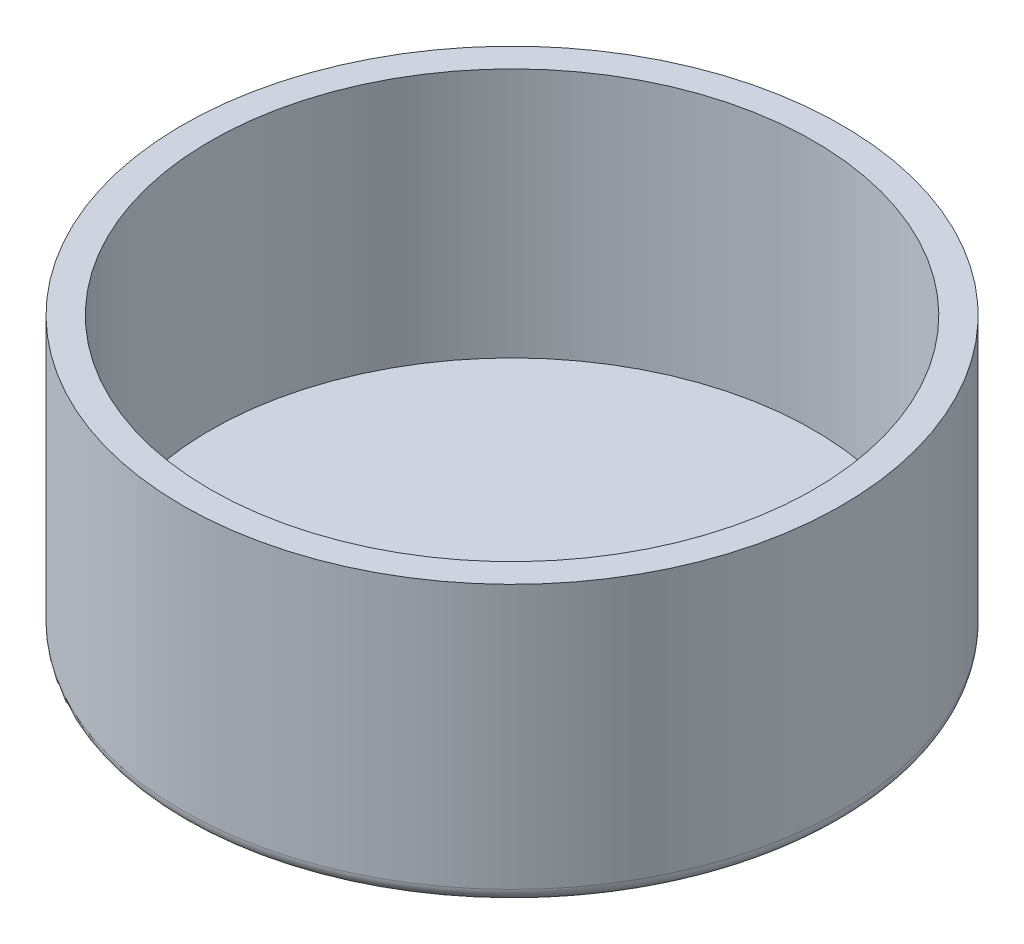
ISO-10303-21;
HEADER;
FILE_DESCRIPTION(('STEP AP214'),'2;1');
FILE_NAME('part.step','',(''),(''),'','','');
FILE_SCHEMA(('AUTOMOTIVE_DESIGN { 1 0 10303 214 1 1 1 1 }'));
ENDSEC;
DATA;
#1=APPLICATION_CONTEXT('core data for automotive mechanical design processes');
#2=APPLICATION_PROTOCOL_DEFINITION('international standard','automotive_design',2000,#1);
#3=PRODUCT_CONTEXT('',#1,'mechanical');
#4=PRODUCT('Part','Part','',(#3));
#5=PRODUCT_RELATED_PRODUCT_CATEGORY('part','',(#4));
#6=PRODUCT_DEFINITION_FORMATION('','',#4);
#7=PRODUCT_DEFINITION_CONTEXT('part definition',#1,'design');
#8=PRODUCT_DEFINITION('design','',#6,#7);
#9=PRODUCT_DEFINITION_SHAPE('','',#8);
#10=(LENGTH_UNIT() NAMED_UNIT(*) SI_UNIT(.MILLI.,.METRE.));
#11=(NAMED_UNIT(*) PLANE_ANGLE_UNIT() SI_UNIT($,.RADIAN.));
#12=(NAMED_UNIT(*) SI_UNIT($,.STERADIAN.) SOLID_ANGLE_UNIT());
#13=UNCERTAINTY_MEASURE_WITH_UNIT(LENGTH_MEASURE(1.E-05),#10,'distance_accuracy_value','');
#14=(GEOMETRIC_REPRESENTATION_CONTEXT(3) GLOBAL_UNCERTAINTY_ASSIGNED_CONTEXT((#13)) GLOBAL_UNIT_ASSIGNED_CONTEXT((#10,
#11,#12)) REPRESENTATION_CONTEXT('',''));
#15=CARTESIAN_POINT('',(0.,0.,0.));
#16=DIRECTION('',(0.,0.,1.));
#17=DIRECTION('',(1.,0.,0.));
#18=AXIS2_PLACEMENT_3D('',#15,#16,#17);
#19=CARTESIAN_POINT('',(0.,1.,0.));
#20=DIRECTION('',(0.,-1.,0.));
#21=DIRECTION('',(0.,0.,-1.));
#22=AXIS2_PLACEMENT_3D('',#19,#20,#21);
#23=CYLINDRICAL_SURFACE('',#22,11.85);
#24=CARTESIAN_POINT('',(0.,0.5,0.));
#25=DIRECTION('',(0.,1.,0.));
#26=DIRECTION('',(0.,0.,1.));
#27=AXIS2_PLACEMENT_3D('',#24,#25,#26);
#28=CIRCLE('',#27,11.85);
#29=CARTESIAN_POINT('',(0.,0.5,11.85));
#30=VERTEX_POINT('',#29);
#31=EDGE_CURVE('E42',#30,#30,#28,.T.);
#32=ORIENTED_EDGE('',*,*,#31,.T.);
#33=EDGE_LOOP('',(#32));
#34=FACE_BOUND('',#33,.T.);
#35=CARTESIAN_POINT('',(0.,10.,0.));
#36=DIRECTION('',(0.,1.,0.));
#37=DIRECTION('',(0.,0.,1.));
#38=AXIS2_PLACEMENT_3D('',#35,#36,#37);
#39=CIRCLE('',#38,11.85);
#40=CARTESIAN_POINT('',(0.,10.,11.85));
#41=VERTEX_POINT('',#40);
#42=EDGE_CURVE('E50',#41,#41,#39,.T.);
#43=ORIENTED_EDGE('',*,*,#42,.F.);
#44=EDGE_LOOP('',(#43));
#45=FACE_BOUND('',#44,.T.);
#46=ADVANCED_FACE('F35',(#34,#45),#23,.T.);
#47=CARTESIAN_POINT('',(0.,0.,0.));
#48=DIRECTION('',(0.,1.,0.));
#49=DIRECTION('',(0.,0.,1.));
#50=AXIS2_PLACEMENT_3D('',#47,#48,#49);
#51=PLANE('',#50);
#52=CARTESIAN_POINT('',(0.,0.,0.));
#53=DIRECTION('',(0.,1.,0.));
#54=DIRECTION('',(0.,0.,1.));
#55=AXIS2_PLACEMENT_3D('',#52,#53,#54);
#56=CIRCLE('',#55,11.35);
#57=CARTESIAN_POINT('',(0.,0.,11.35));
#58=VERTEX_POINT('',#57);
#59=EDGE_CURVE('E10',#58,#58,#56,.F.);
#60=ORIENTED_EDGE('',*,*,#59,.T.);
#61=EDGE_LOOP('',(#60));
#62=FACE_BOUND('',#61,.T.);
#63=ADVANCED_FACE('F64',(#62),#51,.F.);
#64=CARTESIAN_POINT('',(0.,10.,0.));
#65=DIRECTION('',(0.,1.,0.));
#66=DIRECTION('',(0.,0.,1.));
#67=AXIS2_PLACEMENT_3D('',#64,#65,#66);
#68=PLANE('',#67);
#69=ORIENTED_EDGE('',*,*,#42,.T.);
#70=EDGE_LOOP('',(#69));
#71=FACE_BOUND('',#70,.T.);
#72=CARTESIAN_POINT('',(0.,10.,0.));
#73=DIRECTION('',(0.,1.,0.));
#74=DIRECTION('',(0.,0.,1.));
#75=AXIS2_PLACEMENT_3D('',#72,#73,#74);
#76=CIRCLE('',#75,10.85);
#77=CARTESIAN_POINT('',(0.,10.,10.85));
#78=VERTEX_POINT('',#77);
#79=EDGE_CURVE('E55',#78,#78,#76,.T.);
#80=ORIENTED_EDGE('',*,*,#79,.F.);
#81=EDGE_LOOP('',(#80));
#82=FACE_BOUND('',#81,.T.);
#83=ADVANCED_FACE('F62',(#71,#82),#68,.T.);
#84=CARTESIAN_POINT('',(0.,10.,0.));
#85=DIRECTION('',(0.,-1.,0.));
#86=DIRECTION('',(0.,0.,-1.));
#87=AXIS2_PLACEMENT_3D('',#84,#85,#86);
#88=CYLINDRICAL_SURFACE('',#87,10.85);
#89=ORIENTED_EDGE('',*,*,#79,.T.);
#90=EDGE_LOOP('',(#89));
#91=FACE_BOUND('',#90,.T.);
#92=CARTESIAN_POINT('',(0.,1.,0.));
#93=DIRECTION('',(0.,1.,0.));
#94=DIRECTION('',(0.,0.,1.));
#95=AXIS2_PLACEMENT_3D('',#92,#93,#94);
#96=CIRCLE('',#95,10.85);
#97=CARTESIAN_POINT('',(0.,1.,10.85));
#98=VERTEX_POINT('',#97);
#99=EDGE_CURVE('E46',#98,#98,#96,.F.);
#100=ORIENTED_EDGE('',*,*,#99,.T.);
#101=EDGE_LOOP('',(#100));
#102=FACE_BOUND('',#101,.T.);
#103=ADVANCED_FACE('F59',(#91,#102),#88,.F.);
#104=CARTESIAN_POINT('',(0.,1.,0.));
#105=DIRECTION('',(0.,1.,0.));
#106=DIRECTION('',(0.,0.,1.));
#107=AXIS2_PLACEMENT_3D('',#104,#105,#106);
#108=PLANE('',#107);
#109=ORIENTED_EDGE('',*,*,#99,.F.);
#110=EDGE_LOOP('',(#109));
#111=FACE_BOUND('',#110,.T.);
#112=ADVANCED_FACE('F71',(#111),#108,.T.);
#113=CARTESIAN_POINT('',(0.,0.5,0.));
#114=DIRECTION('',(0.,1.,0.));
#115=DIRECTION('',(0.,0.,1.));
#116=AXIS2_PLACEMENT_3D('',#113,#114,#115);
#117=TOROIDAL_SURFACE('',#116,11.35,0.5);
#118=ORIENTED_EDGE('',*,*,#59,.F.);
#119=EDGE_LOOP('',(#118));
#120=FACE_BOUND('',#119,.T.);
#121=ORIENTED_EDGE('',*,*,#31,.F.);
#122=EDGE_LOOP('',(#121));
#123=FACE_BOUND('',#122,.T.);
#124=ADVANCED_FACE('F37',(#120,#123),#117,.T.);
#125=CLOSED_SHELL('',(#46,#63,#83,#103,#112,#124));
#126=MANIFOLD_SOLID_BREP('B2',#125);
#127=ADVANCED_BREP_SHAPE_REPRESENTATION('',(#18,#126),#14);
#128=SHAPE_DEFINITION_REPRESENTATION(#9,#127);
ENDSEC;
END-ISO-10303-21;
